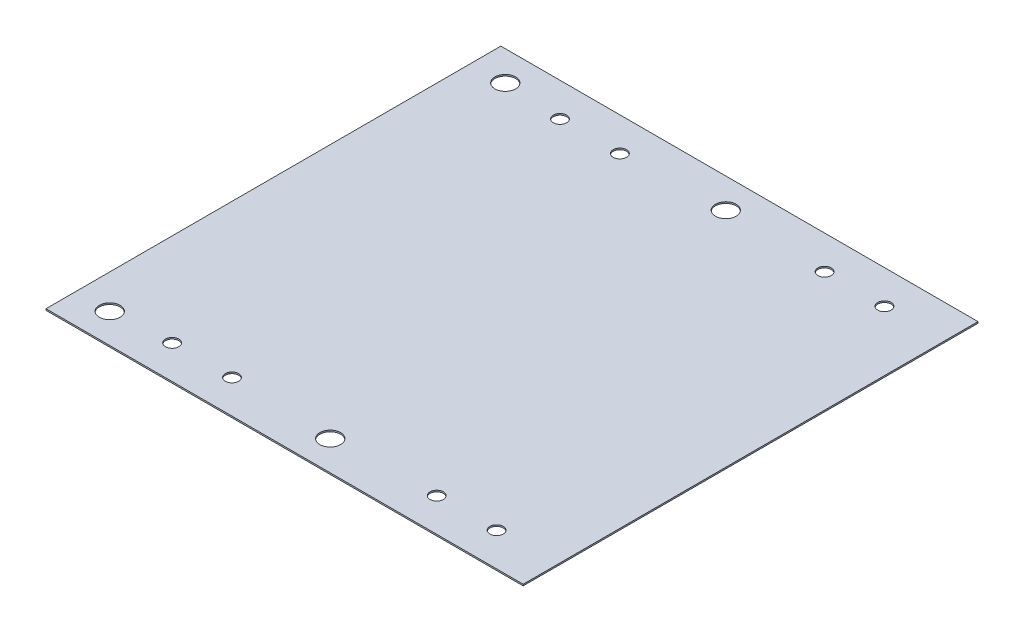
ISO-10303-21;
HEADER;
FILE_DESCRIPTION(('STEP AP214'),'2;1');
FILE_NAME('part.step','',(''),(''),'','','');
FILE_SCHEMA(('AUTOMOTIVE_DESIGN { 1 0 10303 214 1 1 1 1 }'));
ENDSEC;
DATA;
#1=APPLICATION_CONTEXT('core data for automotive mechanical design processes');
#2=APPLICATION_PROTOCOL_DEFINITION('international standard','automotive_design',2000,#1);
#3=PRODUCT_CONTEXT('',#1,'mechanical');
#4=PRODUCT('Part','Part','',(#3));
#5=PRODUCT_RELATED_PRODUCT_CATEGORY('part','',(#4));
#6=PRODUCT_DEFINITION_FORMATION('','',#4);
#7=PRODUCT_DEFINITION_CONTEXT('part definition',#1,'design');
#8=PRODUCT_DEFINITION('design','',#6,#7);
#9=PRODUCT_DEFINITION_SHAPE('','',#8);
#10=(LENGTH_UNIT() NAMED_UNIT(*) SI_UNIT(.MILLI.,.METRE.));
#11=(NAMED_UNIT(*) PLANE_ANGLE_UNIT() SI_UNIT($,.RADIAN.));
#12=(NAMED_UNIT(*) SI_UNIT($,.STERADIAN.) SOLID_ANGLE_UNIT());
#13=UNCERTAINTY_MEASURE_WITH_UNIT(LENGTH_MEASURE(1.E-05),#10,'distance_accuracy_value','');
#14=(GEOMETRIC_REPRESENTATION_CONTEXT(3) GLOBAL_UNCERTAINTY_ASSIGNED_CONTEXT((#13)) GLOBAL_UNIT_ASSIGNED_CONTEXT((#10,
#11,#12)) REPRESENTATION_CONTEXT('',''));
#15=CARTESIAN_POINT('',(0.,0.,0.));
#16=DIRECTION('',(0.,0.,1.));
#17=DIRECTION('',(1.,0.,0.));
#18=AXIS2_PLACEMENT_3D('',#15,#16,#17);
#19=CARTESIAN_POINT('',(40.25,0.25,38.3675));
#20=DIRECTION('',(0.,1.,0.));
#21=DIRECTION('',(0.,0.,1.));
#22=AXIS2_PLACEMENT_3D('',#19,#20,#21);
#23=PLANE('',#22);
#24=CARTESIAN_POINT('',(20.02,0.25,32.7175));
#25=DIRECTION('',(0.,1.,0.));
#26=DIRECTION('',(0.,0.,1.));
#27=AXIS2_PLACEMENT_3D('',#24,#25,#26);
#28=CIRCLE('',#27,1.125);
#29=CARTESIAN_POINT('',(20.02,0.25,33.8425));
#30=VERTEX_POINT('',#29);
#31=EDGE_CURVE('E167',#30,#30,#28,.T.);
#32=ORIENTED_EDGE('',*,*,#31,.F.);
#33=EDGE_LOOP('',(#32));
#34=FACE_BOUND('',#33,.T.);
#35=CARTESIAN_POINT('',(-24.62,0.25,32.7175));
#36=DIRECTION('',(0.,1.,0.));
#37=DIRECTION('',(0.,0.,1.));
#38=AXIS2_PLACEMENT_3D('',#35,#36,#37);
#39=CIRCLE('',#38,1.125);
#40=CARTESIAN_POINT('',(-24.62,0.25,33.8425));
#41=VERTEX_POINT('',#40);
#42=EDGE_CURVE('E155',#41,#41,#39,.T.);
#43=ORIENTED_EDGE('',*,*,#42,.F.);
#44=EDGE_LOOP('',(#43));
#45=FACE_BOUND('',#44,.T.);
#46=CARTESIAN_POINT('',(-34.5,0.25,33.3675));
#47=DIRECTION('',(0.,1.,0.));
#48=DIRECTION('',(0.,0.,1.));
#49=AXIS2_PLACEMENT_3D('',#46,#47,#48);
#50=CIRCLE('',#49,1.75);
#51=CARTESIAN_POINT('',(-34.5,0.25,35.1175));
#52=VERTEX_POINT('',#51);
#53=EDGE_CURVE('E143',#52,#52,#50,.T.);
#54=ORIENTED_EDGE('',*,*,#53,.F.);
#55=EDGE_LOOP('',(#54));
#56=FACE_BOUND('',#55,.T.);
#57=CARTESIAN_POINT('',(20.02,0.25,-32.7175));
#58=DIRECTION('',(0.,1.,0.));
#59=DIRECTION('',(0.,0.,1.));
#60=AXIS2_PLACEMENT_3D('',#57,#58,#59);
#61=CIRCLE('',#60,1.125);
#62=CARTESIAN_POINT('',(20.02,0.25,-31.5925));
#63=VERTEX_POINT('',#62);
#64=EDGE_CURVE('E131',#63,#63,#61,.T.);
#65=ORIENTED_EDGE('',*,*,#64,.F.);
#66=EDGE_LOOP('',(#65));
#67=FACE_BOUND('',#66,.T.);
#68=CARTESIAN_POINT('',(-14.52,0.25,-32.7175));
#69=DIRECTION('',(0.,1.,0.));
#70=DIRECTION('',(0.,0.,1.));
#71=AXIS2_PLACEMENT_3D('',#68,#69,#70);
#72=CIRCLE('',#71,1.125);
#73=CARTESIAN_POINT('',(-14.52,0.25,-31.5925));
#74=VERTEX_POINT('',#73);
#75=EDGE_CURVE('E119',#74,#74,#72,.T.);
#76=ORIENTED_EDGE('',*,*,#75,.F.);
#77=EDGE_LOOP('',(#76));
#78=FACE_BOUND('',#77,.T.);
#79=CARTESIAN_POINT('',(-34.5,0.25,-33.3675));
#80=DIRECTION('',(0.,1.,0.));
#81=DIRECTION('',(0.,0.,1.));
#82=AXIS2_PLACEMENT_3D('',#79,#80,#81);
#83=CIRCLE('',#82,1.75);
#84=CARTESIAN_POINT('',(-34.5,0.25,-31.6175));
#85=VERTEX_POINT('',#84);
#86=EDGE_CURVE('E98',#85,#85,#83,.T.);
#87=ORIENTED_EDGE('',*,*,#86,.F.);
#88=EDGE_LOOP('',(#87));
#89=FACE_BOUND('',#88,.T.);
#90=DIRECTION('',(0.,0.,-1.));
#91=VECTOR('',#90,1.);
#92=CARTESIAN_POINT('',(40.25,0.25,-38.3675));
#93=LINE('',#92,#91);
#94=CARTESIAN_POINT('',(40.25,0.25,38.3675));
#95=VERTEX_POINT('',#94);
#96=CARTESIAN_POINT('',(40.25,0.25,-38.3675));
#97=VERTEX_POINT('',#96);
#98=EDGE_CURVE('E83',#95,#97,#93,.T.);
#99=ORIENTED_EDGE('',*,*,#98,.T.);
#100=DIRECTION('',(-1.,0.,0.));
#101=VECTOR('',#100,1.);
#102=CARTESIAN_POINT('',(-40.25,0.25,-38.3675));
#103=LINE('',#102,#101);
#104=CARTESIAN_POINT('',(-40.25,0.25,-38.3675));
#105=VERTEX_POINT('',#104);
#106=EDGE_CURVE('E78',#97,#105,#103,.T.);
#107=ORIENTED_EDGE('',*,*,#106,.T.);
#108=DIRECTION('',(0.,0.,1.));
#109=VECTOR('',#108,1.);
#110=CARTESIAN_POINT('',(-40.25,0.25,-38.3675));
#111=LINE('',#110,#109);
#112=CARTESIAN_POINT('',(-40.25,0.25,38.3675));
#113=VERTEX_POINT('',#112);
#114=EDGE_CURVE('E81',#105,#113,#111,.T.);
#115=ORIENTED_EDGE('',*,*,#114,.T.);
#116=DIRECTION('',(1.,0.,0.));
#117=VECTOR('',#116,1.);
#118=CARTESIAN_POINT('',(-40.25,0.25,38.3675));
#119=LINE('',#118,#117);
#120=EDGE_CURVE('E48',#113,#95,#119,.T.);
#121=ORIENTED_EDGE('',*,*,#120,.T.);
#122=EDGE_LOOP('',(#99,#107,#115,#121));
#123=FACE_BOUND('',#122,.T.);
#124=CARTESIAN_POINT('',(-24.62,0.25,-32.7175));
#125=DIRECTION('',(0.,1.,0.));
#126=DIRECTION('',(0.,0.,1.));
#127=AXIS2_PLACEMENT_3D('',#124,#125,#126);
#128=CIRCLE('',#127,1.125);
#129=CARTESIAN_POINT('',(-24.62,0.25,-31.5925));
#130=VERTEX_POINT('',#129);
#131=EDGE_CURVE('E113',#130,#130,#128,.T.);
#132=ORIENTED_EDGE('',*,*,#131,.F.);
#133=EDGE_LOOP('',(#132));
#134=FACE_BOUND('',#133,.T.);
#135=CARTESIAN_POINT('',(2.69999999999999,0.25,-33.3675));
#136=DIRECTION('',(0.,1.,0.));
#137=DIRECTION('',(0.,0.,1.));
#138=AXIS2_PLACEMENT_3D('',#135,#136,#137);
#139=CIRCLE('',#138,1.75);
#140=CARTESIAN_POINT('',(2.69999999999999,0.25,-31.6175));
#141=VERTEX_POINT('',#140);
#142=EDGE_CURVE('E125',#141,#141,#139,.T.);
#143=ORIENTED_EDGE('',*,*,#142,.F.);
#144=EDGE_LOOP('',(#143));
#145=FACE_BOUND('',#144,.T.);
#146=CARTESIAN_POINT('',(30.12,0.25,-32.7175));
#147=DIRECTION('',(0.,1.,0.));
#148=DIRECTION('',(0.,0.,1.));
#149=AXIS2_PLACEMENT_3D('',#146,#147,#148);
#150=CIRCLE('',#149,1.125);
#151=CARTESIAN_POINT('',(30.12,0.25,-31.5925));
#152=VERTEX_POINT('',#151);
#153=EDGE_CURVE('E137',#152,#152,#150,.T.);
#154=ORIENTED_EDGE('',*,*,#153,.F.);
#155=EDGE_LOOP('',(#154));
#156=FACE_BOUND('',#155,.T.);
#157=CARTESIAN_POINT('',(2.69999999999999,0.25,33.3675));
#158=DIRECTION('',(0.,1.,0.));
#159=DIRECTION('',(0.,0.,1.));
#160=AXIS2_PLACEMENT_3D('',#157,#158,#159);
#161=CIRCLE('',#160,1.75);
#162=CARTESIAN_POINT('',(2.69999999999999,0.25,35.1175));
#163=VERTEX_POINT('',#162);
#164=EDGE_CURVE('E149',#163,#163,#161,.T.);
#165=ORIENTED_EDGE('',*,*,#164,.F.);
#166=EDGE_LOOP('',(#165));
#167=FACE_BOUND('',#166,.T.);
#168=CARTESIAN_POINT('',(-14.52,0.25,32.7175));
#169=DIRECTION('',(0.,1.,0.));
#170=DIRECTION('',(0.,0.,1.));
#171=AXIS2_PLACEMENT_3D('',#168,#169,#170);
#172=CIRCLE('',#171,1.125);
#173=CARTESIAN_POINT('',(-14.52,0.25,33.8425));
#174=VERTEX_POINT('',#173);
#175=EDGE_CURVE('E161',#174,#174,#172,.T.);
#176=ORIENTED_EDGE('',*,*,#175,.F.);
#177=EDGE_LOOP('',(#176));
#178=FACE_BOUND('',#177,.T.);
#179=CARTESIAN_POINT('',(30.12,0.25,32.7175));
#180=DIRECTION('',(0.,1.,0.));
#181=DIRECTION('',(0.,0.,1.));
#182=AXIS2_PLACEMENT_3D('',#179,#180,#181);
#183=CIRCLE('',#182,1.125);
#184=CARTESIAN_POINT('',(30.12,0.25,33.8425));
#185=VERTEX_POINT('',#184);
#186=EDGE_CURVE('E173',#185,#185,#183,.T.);
#187=ORIENTED_EDGE('',*,*,#186,.F.);
#188=EDGE_LOOP('',(#187));
#189=FACE_BOUND('',#188,.T.);
#190=ADVANCED_FACE('F31',(#34,#45,#56,#67,#78,#89,#123,#134,#145,#156,#167,#178,#189),#23,.T.);
#191=CARTESIAN_POINT('',(40.25,0.,38.3675));
#192=DIRECTION('',(0.,1.,0.));
#193=DIRECTION('',(0.,0.,1.));
#194=AXIS2_PLACEMENT_3D('',#191,#192,#193);
#195=PLANE('',#194);
#196=CARTESIAN_POINT('',(20.02,0.,32.7175));
#197=DIRECTION('',(0.,1.,0.));
#198=DIRECTION('',(0.,0.,1.));
#199=AXIS2_PLACEMENT_3D('',#196,#197,#198);
#200=CIRCLE('',#199,1.125);
#201=CARTESIAN_POINT('',(20.02,0.,33.8425));
#202=VERTEX_POINT('',#201);
#203=EDGE_CURVE('E170',#202,#202,#200,.T.);
#204=ORIENTED_EDGE('',*,*,#203,.T.);
#205=EDGE_LOOP('',(#204));
#206=FACE_BOUND('',#205,.T.);
#207=CARTESIAN_POINT('',(-24.62,0.,32.7175));
#208=DIRECTION('',(0.,1.,0.));
#209=DIRECTION('',(0.,0.,1.));
#210=AXIS2_PLACEMENT_3D('',#207,#208,#209);
#211=CIRCLE('',#210,1.125);
#212=CARTESIAN_POINT('',(-24.62,0.,33.8425));
#213=VERTEX_POINT('',#212);
#214=EDGE_CURVE('E158',#213,#213,#211,.T.);
#215=ORIENTED_EDGE('',*,*,#214,.T.);
#216=EDGE_LOOP('',(#215));
#217=FACE_BOUND('',#216,.T.);
#218=CARTESIAN_POINT('',(-34.5,0.,33.3675));
#219=DIRECTION('',(0.,1.,0.));
#220=DIRECTION('',(0.,0.,1.));
#221=AXIS2_PLACEMENT_3D('',#218,#219,#220);
#222=CIRCLE('',#221,1.75);
#223=CARTESIAN_POINT('',(-34.5,0.,35.1175));
#224=VERTEX_POINT('',#223);
#225=EDGE_CURVE('E146',#224,#224,#222,.T.);
#226=ORIENTED_EDGE('',*,*,#225,.T.);
#227=EDGE_LOOP('',(#226));
#228=FACE_BOUND('',#227,.T.);
#229=CARTESIAN_POINT('',(20.02,0.,-32.7175));
#230=DIRECTION('',(0.,1.,0.));
#231=DIRECTION('',(0.,0.,1.));
#232=AXIS2_PLACEMENT_3D('',#229,#230,#231);
#233=CIRCLE('',#232,1.125);
#234=CARTESIAN_POINT('',(20.02,0.,-31.5925));
#235=VERTEX_POINT('',#234);
#236=EDGE_CURVE('E134',#235,#235,#233,.T.);
#237=ORIENTED_EDGE('',*,*,#236,.T.);
#238=EDGE_LOOP('',(#237));
#239=FACE_BOUND('',#238,.T.);
#240=CARTESIAN_POINT('',(-14.52,0.,-32.7175));
#241=DIRECTION('',(0.,1.,0.));
#242=DIRECTION('',(0.,0.,1.));
#243=AXIS2_PLACEMENT_3D('',#240,#241,#242);
#244=CIRCLE('',#243,1.125);
#245=CARTESIAN_POINT('',(-14.52,0.,-31.5925));
#246=VERTEX_POINT('',#245);
#247=EDGE_CURVE('E122',#246,#246,#244,.T.);
#248=ORIENTED_EDGE('',*,*,#247,.T.);
#249=EDGE_LOOP('',(#248));
#250=FACE_BOUND('',#249,.T.);
#251=CARTESIAN_POINT('',(-34.5,0.,-33.3675));
#252=DIRECTION('',(0.,1.,0.));
#253=DIRECTION('',(0.,0.,1.));
#254=AXIS2_PLACEMENT_3D('',#251,#252,#253);
#255=CIRCLE('',#254,1.75);
#256=CARTESIAN_POINT('',(-34.5,0.,-31.6175));
#257=VERTEX_POINT('',#256);
#258=EDGE_CURVE('E110',#257,#257,#255,.T.);
#259=ORIENTED_EDGE('',*,*,#258,.T.);
#260=EDGE_LOOP('',(#259));
#261=FACE_BOUND('',#260,.T.);
#262=DIRECTION('',(0.,0.,-1.));
#263=VECTOR('',#262,1.);
#264=CARTESIAN_POINT('',(40.25,0.,-38.3675));
#265=LINE('',#264,#263);
#266=CARTESIAN_POINT('',(40.25,0.,38.3675));
#267=VERTEX_POINT('',#266);
#268=CARTESIAN_POINT('',(40.25,0.,-38.3675));
#269=VERTEX_POINT('',#268);
#270=EDGE_CURVE('E95',#267,#269,#265,.T.);
#271=ORIENTED_EDGE('',*,*,#270,.F.);
#272=DIRECTION('',(1.,0.,0.));
#273=VECTOR('',#272,1.);
#274=CARTESIAN_POINT('',(-40.25,0.,38.3675));
#275=LINE('',#274,#273);
#276=CARTESIAN_POINT('',(-40.25,0.,38.3675));
#277=VERTEX_POINT('',#276);
#278=EDGE_CURVE('E71',#277,#267,#275,.T.);
#279=ORIENTED_EDGE('',*,*,#278,.F.);
#280=DIRECTION('',(0.,0.,1.));
#281=VECTOR('',#280,1.);
#282=CARTESIAN_POINT('',(-40.25,0.,-38.3675));
#283=LINE('',#282,#281);
#284=CARTESIAN_POINT('',(-40.25,0.,-38.3675));
#285=VERTEX_POINT('',#284);
#286=EDGE_CURVE('E65',#285,#277,#283,.T.);
#287=ORIENTED_EDGE('',*,*,#286,.F.);
#288=DIRECTION('',(-1.,0.,0.));
#289=VECTOR('',#288,1.);
#290=CARTESIAN_POINT('',(-40.25,0.,-38.3675));
#291=LINE('',#290,#289);
#292=EDGE_CURVE('E87',#269,#285,#291,.T.);
#293=ORIENTED_EDGE('',*,*,#292,.F.);
#294=EDGE_LOOP('',(#271,#279,#287,#293));
#295=FACE_BOUND('',#294,.T.);
#296=CARTESIAN_POINT('',(-24.62,0.,-32.7175));
#297=DIRECTION('',(0.,1.,0.));
#298=DIRECTION('',(0.,0.,1.));
#299=AXIS2_PLACEMENT_3D('',#296,#297,#298);
#300=CIRCLE('',#299,1.125);
#301=CARTESIAN_POINT('',(-24.62,0.,-31.5925));
#302=VERTEX_POINT('',#301);
#303=EDGE_CURVE('E116',#302,#302,#300,.T.);
#304=ORIENTED_EDGE('',*,*,#303,.T.);
#305=EDGE_LOOP('',(#304));
#306=FACE_BOUND('',#305,.T.);
#307=CARTESIAN_POINT('',(2.69999999999999,0.,-33.3675));
#308=DIRECTION('',(0.,1.,0.));
#309=DIRECTION('',(0.,0.,1.));
#310=AXIS2_PLACEMENT_3D('',#307,#308,#309);
#311=CIRCLE('',#310,1.75);
#312=CARTESIAN_POINT('',(2.69999999999999,0.,-31.6175));
#313=VERTEX_POINT('',#312);
#314=EDGE_CURVE('E128',#313,#313,#311,.T.);
#315=ORIENTED_EDGE('',*,*,#314,.T.);
#316=EDGE_LOOP('',(#315));
#317=FACE_BOUND('',#316,.T.);
#318=CARTESIAN_POINT('',(30.12,0.,-32.7175));
#319=DIRECTION('',(0.,1.,0.));
#320=DIRECTION('',(0.,0.,1.));
#321=AXIS2_PLACEMENT_3D('',#318,#319,#320);
#322=CIRCLE('',#321,1.125);
#323=CARTESIAN_POINT('',(30.12,0.,-31.5925));
#324=VERTEX_POINT('',#323);
#325=EDGE_CURVE('E140',#324,#324,#322,.T.);
#326=ORIENTED_EDGE('',*,*,#325,.T.);
#327=EDGE_LOOP('',(#326));
#328=FACE_BOUND('',#327,.T.);
#329=CARTESIAN_POINT('',(2.69999999999999,0.,33.3675));
#330=DIRECTION('',(0.,1.,0.));
#331=DIRECTION('',(0.,0.,1.));
#332=AXIS2_PLACEMENT_3D('',#329,#330,#331);
#333=CIRCLE('',#332,1.75);
#334=CARTESIAN_POINT('',(2.69999999999999,0.,35.1175));
#335=VERTEX_POINT('',#334);
#336=EDGE_CURVE('E152',#335,#335,#333,.T.);
#337=ORIENTED_EDGE('',*,*,#336,.T.);
#338=EDGE_LOOP('',(#337));
#339=FACE_BOUND('',#338,.T.);
#340=CARTESIAN_POINT('',(-14.52,0.,32.7175));
#341=DIRECTION('',(0.,1.,0.));
#342=DIRECTION('',(0.,0.,1.));
#343=AXIS2_PLACEMENT_3D('',#340,#341,#342);
#344=CIRCLE('',#343,1.125);
#345=CARTESIAN_POINT('',(-14.52,0.,33.8425));
#346=VERTEX_POINT('',#345);
#347=EDGE_CURVE('E164',#346,#346,#344,.T.);
#348=ORIENTED_EDGE('',*,*,#347,.T.);
#349=EDGE_LOOP('',(#348));
#350=FACE_BOUND('',#349,.T.);
#351=CARTESIAN_POINT('',(30.12,0.,32.7175));
#352=DIRECTION('',(0.,1.,0.));
#353=DIRECTION('',(0.,0.,1.));
#354=AXIS2_PLACEMENT_3D('',#351,#352,#353);
#355=CIRCLE('',#354,1.125);
#356=CARTESIAN_POINT('',(30.12,0.,33.8425));
#357=VERTEX_POINT('',#356);
#358=EDGE_CURVE('E176',#357,#357,#355,.T.);
#359=ORIENTED_EDGE('',*,*,#358,.T.);
#360=EDGE_LOOP('',(#359));
#361=FACE_BOUND('',#360,.T.);
#362=ADVANCED_FACE('F106',(#206,#217,#228,#239,#250,#261,#295,#306,#317,#328,#339,#350,#361),
#195,.F.);
#363=CARTESIAN_POINT('',(40.25,0.25,-38.3675));
#364=DIRECTION('',(-1.,0.,0.));
#365=DIRECTION('',(0.,0.,1.));
#366=AXIS2_PLACEMENT_3D('',#363,#364,#365);
#367=PLANE('',#366);
#368=ORIENTED_EDGE('',*,*,#270,.T.);
#369=DIRECTION('',(0.,-1.,0.));
#370=VECTOR('',#369,1.);
#371=CARTESIAN_POINT('',(40.25,0.25,-38.3675));
#372=LINE('',#371,#370);
#373=EDGE_CURVE('E11',#97,#269,#372,.T.);
#374=ORIENTED_EDGE('',*,*,#373,.F.);
#375=ORIENTED_EDGE('',*,*,#98,.F.);
#376=DIRECTION('',(0.,-1.,0.));
#377=VECTOR('',#376,1.);
#378=CARTESIAN_POINT('',(40.25,0.25,38.3675));
#379=LINE('',#378,#377);
#380=EDGE_CURVE('E91',#95,#267,#379,.T.);
#381=ORIENTED_EDGE('',*,*,#380,.T.);
#382=EDGE_LOOP('',(#368,#374,#375,#381));
#383=FACE_BOUND('',#382,.T.);
#384=ADVANCED_FACE('F33',(#383),#367,.F.);
#385=CARTESIAN_POINT('',(-40.25,0.25,-38.3675));
#386=DIRECTION('',(0.,0.,1.));
#387=DIRECTION('',(1.,0.,0.));
#388=AXIS2_PLACEMENT_3D('',#385,#386,#387);
#389=PLANE('',#388);
#390=ORIENTED_EDGE('',*,*,#292,.T.);
#391=DIRECTION('',(0.,-1.,0.));
#392=VECTOR('',#391,1.);
#393=CARTESIAN_POINT('',(-40.25,0.25,-38.3675));
#394=LINE('',#393,#392);
#395=EDGE_CURVE('E40',#105,#285,#394,.T.);
#396=ORIENTED_EDGE('',*,*,#395,.F.);
#397=ORIENTED_EDGE('',*,*,#106,.F.);
#398=ORIENTED_EDGE('',*,*,#373,.T.);
#399=EDGE_LOOP('',(#390,#396,#397,#398));
#400=FACE_BOUND('',#399,.T.);
#401=ADVANCED_FACE('F86',(#400),#389,.F.);
#402=CARTESIAN_POINT('',(-40.25,0.25,-38.3675));
#403=DIRECTION('',(1.,0.,0.));
#404=DIRECTION('',(0.,0.,-1.));
#405=AXIS2_PLACEMENT_3D('',#402,#403,#404);
#406=PLANE('',#405);
#407=ORIENTED_EDGE('',*,*,#286,.T.);
#408=DIRECTION('',(0.,-1.,0.));
#409=VECTOR('',#408,1.);
#410=CARTESIAN_POINT('',(-40.25,0.25,38.3675));
#411=LINE('',#410,#409);
#412=EDGE_CURVE('E88',#113,#277,#411,.T.);
#413=ORIENTED_EDGE('',*,*,#412,.F.);
#414=ORIENTED_EDGE('',*,*,#114,.F.);
#415=ORIENTED_EDGE('',*,*,#395,.T.);
#416=EDGE_LOOP('',(#407,#413,#414,#415));
#417=FACE_BOUND('',#416,.T.);
#418=ADVANCED_FACE('F89',(#417),#406,.F.);
#419=CARTESIAN_POINT('',(-40.25,0.25,38.3675));
#420=DIRECTION('',(0.,0.,-1.));
#421=DIRECTION('',(-1.,0.,0.));
#422=AXIS2_PLACEMENT_3D('',#419,#420,#421);
#423=PLANE('',#422);
#424=ORIENTED_EDGE('',*,*,#278,.T.);
#425=ORIENTED_EDGE('',*,*,#380,.F.);
#426=ORIENTED_EDGE('',*,*,#120,.F.);
#427=ORIENTED_EDGE('',*,*,#412,.T.);
#428=EDGE_LOOP('',(#424,#425,#426,#427));
#429=FACE_BOUND('',#428,.T.);
#430=ADVANCED_FACE('F103',(#429),#423,.F.);
#431=CARTESIAN_POINT('',(-34.5,0.25,-33.3675));
#432=DIRECTION('',(0.,-1.,0.));
#433=DIRECTION('',(0.,0.,-1.));
#434=AXIS2_PLACEMENT_3D('',#431,#432,#433);
#435=CYLINDRICAL_SURFACE('',#434,1.75);
#436=ORIENTED_EDGE('',*,*,#86,.T.);
#437=EDGE_LOOP('',(#436));
#438=FACE_BOUND('',#437,.T.);
#439=ORIENTED_EDGE('',*,*,#258,.F.);
#440=EDGE_LOOP('',(#439));
#441=FACE_BOUND('',#440,.T.);
#442=ADVANCED_FACE('F196',(#438,#441),#435,.F.);
#443=CARTESIAN_POINT('',(-24.62,0.25,-32.7175));
#444=DIRECTION('',(0.,-1.,0.));
#445=DIRECTION('',(0.,0.,-1.));
#446=AXIS2_PLACEMENT_3D('',#443,#444,#445);
#447=CYLINDRICAL_SURFACE('',#446,1.125);
#448=ORIENTED_EDGE('',*,*,#131,.T.);
#449=EDGE_LOOP('',(#448));
#450=FACE_BOUND('',#449,.T.);
#451=ORIENTED_EDGE('',*,*,#303,.F.);
#452=EDGE_LOOP('',(#451));
#453=FACE_BOUND('',#452,.T.);
#454=ADVANCED_FACE('F242',(#450,#453),#447,.F.);
#455=CARTESIAN_POINT('',(-14.52,0.25,-32.7175));
#456=DIRECTION('',(0.,-1.,0.));
#457=DIRECTION('',(0.,0.,-1.));
#458=AXIS2_PLACEMENT_3D('',#455,#456,#457);
#459=CYLINDRICAL_SURFACE('',#458,1.125);
#460=ORIENTED_EDGE('',*,*,#75,.T.);
#461=EDGE_LOOP('',(#460));
#462=FACE_BOUND('',#461,.T.);
#463=ORIENTED_EDGE('',*,*,#247,.F.);
#464=EDGE_LOOP('',(#463));
#465=FACE_BOUND('',#464,.T.);
#466=ADVANCED_FACE('F250',(#462,#465),#459,.F.);
#467=CARTESIAN_POINT('',(2.69999999999999,0.25,-33.3675));
#468=DIRECTION('',(0.,-1.,0.));
#469=DIRECTION('',(0.,0.,-1.));
#470=AXIS2_PLACEMENT_3D('',#467,#468,#469);
#471=CYLINDRICAL_SURFACE('',#470,1.75);
#472=ORIENTED_EDGE('',*,*,#142,.T.);
#473=EDGE_LOOP('',(#472));
#474=FACE_BOUND('',#473,.T.);
#475=ORIENTED_EDGE('',*,*,#314,.F.);
#476=EDGE_LOOP('',(#475));
#477=FACE_BOUND('',#476,.T.);
#478=ADVANCED_FACE('F258',(#474,#477),#471,.F.);
#479=CARTESIAN_POINT('',(20.02,0.25,-32.7175));
#480=DIRECTION('',(0.,-1.,0.));
#481=DIRECTION('',(0.,0.,-1.));
#482=AXIS2_PLACEMENT_3D('',#479,#480,#481);
#483=CYLINDRICAL_SURFACE('',#482,1.125);
#484=ORIENTED_EDGE('',*,*,#64,.T.);
#485=EDGE_LOOP('',(#484));
#486=FACE_BOUND('',#485,.T.);
#487=ORIENTED_EDGE('',*,*,#236,.F.);
#488=EDGE_LOOP('',(#487));
#489=FACE_BOUND('',#488,.T.);
#490=ADVANCED_FACE('F267',(#486,#489),#483,.F.);
#491=CARTESIAN_POINT('',(30.12,0.25,-32.7175));
#492=DIRECTION('',(0.,-1.,0.));
#493=DIRECTION('',(0.,0.,-1.));
#494=AXIS2_PLACEMENT_3D('',#491,#492,#493);
#495=CYLINDRICAL_SURFACE('',#494,1.125);
#496=ORIENTED_EDGE('',*,*,#153,.T.);
#497=EDGE_LOOP('',(#496));
#498=FACE_BOUND('',#497,.T.);
#499=ORIENTED_EDGE('',*,*,#325,.F.);
#500=EDGE_LOOP('',(#499));
#501=FACE_BOUND('',#500,.T.);
#502=ADVANCED_FACE('F276',(#498,#501),#495,.F.);
#503=CARTESIAN_POINT('',(-34.5,0.25,33.3675));
#504=DIRECTION('',(0.,-1.,0.));
#505=DIRECTION('',(0.,0.,-1.));
#506=AXIS2_PLACEMENT_3D('',#503,#504,#505);
#507=CYLINDRICAL_SURFACE('',#506,1.75);
#508=ORIENTED_EDGE('',*,*,#53,.T.);
#509=EDGE_LOOP('',(#508));
#510=FACE_BOUND('',#509,.T.);
#511=ORIENTED_EDGE('',*,*,#225,.F.);
#512=EDGE_LOOP('',(#511));
#513=FACE_BOUND('',#512,.T.);
#514=ADVANCED_FACE('F285',(#510,#513),#507,.F.);
#515=CARTESIAN_POINT('',(2.69999999999999,0.25,33.3675));
#516=DIRECTION('',(0.,-1.,0.));
#517=DIRECTION('',(0.,0.,-1.));
#518=AXIS2_PLACEMENT_3D('',#515,#516,#517);
#519=CYLINDRICAL_SURFACE('',#518,1.75);
#520=ORIENTED_EDGE('',*,*,#164,.T.);
#521=EDGE_LOOP('',(#520));
#522=FACE_BOUND('',#521,.T.);
#523=ORIENTED_EDGE('',*,*,#336,.F.);
#524=EDGE_LOOP('',(#523));
#525=FACE_BOUND('',#524,.T.);
#526=ADVANCED_FACE('F294',(#522,#525),#519,.F.);
#527=CARTESIAN_POINT('',(-24.62,0.25,32.7175));
#528=DIRECTION('',(0.,-1.,0.));
#529=DIRECTION('',(0.,0.,-1.));
#530=AXIS2_PLACEMENT_3D('',#527,#528,#529);
#531=CYLINDRICAL_SURFACE('',#530,1.125);
#532=ORIENTED_EDGE('',*,*,#42,.T.);
#533=EDGE_LOOP('',(#532));
#534=FACE_BOUND('',#533,.T.);
#535=ORIENTED_EDGE('',*,*,#214,.F.);
#536=EDGE_LOOP('',(#535));
#537=FACE_BOUND('',#536,.T.);
#538=ADVANCED_FACE('F303',(#534,#537),#531,.F.);
#539=CARTESIAN_POINT('',(-14.52,0.25,32.7175));
#540=DIRECTION('',(0.,-1.,0.));
#541=DIRECTION('',(0.,0.,-1.));
#542=AXIS2_PLACEMENT_3D('',#539,#540,#541);
#543=CYLINDRICAL_SURFACE('',#542,1.125);
#544=ORIENTED_EDGE('',*,*,#175,.T.);
#545=EDGE_LOOP('',(#544));
#546=FACE_BOUND('',#545,.T.);
#547=ORIENTED_EDGE('',*,*,#347,.F.);
#548=EDGE_LOOP('',(#547));
#549=FACE_BOUND('',#548,.T.);
#550=ADVANCED_FACE('F312',(#546,#549),#543,.F.);
#551=CARTESIAN_POINT('',(20.02,0.25,32.7175));
#552=DIRECTION('',(0.,-1.,0.));
#553=DIRECTION('',(0.,0.,-1.));
#554=AXIS2_PLACEMENT_3D('',#551,#552,#553);
#555=CYLINDRICAL_SURFACE('',#554,1.125);
#556=ORIENTED_EDGE('',*,*,#31,.T.);
#557=EDGE_LOOP('',(#556));
#558=FACE_BOUND('',#557,.T.);
#559=ORIENTED_EDGE('',*,*,#203,.F.);
#560=EDGE_LOOP('',(#559));
#561=FACE_BOUND('',#560,.T.);
#562=ADVANCED_FACE('F321',(#558,#561),#555,.F.);
#563=CARTESIAN_POINT('',(30.12,0.25,32.7175));
#564=DIRECTION('',(0.,-1.,0.));
#565=DIRECTION('',(0.,0.,-1.));
#566=AXIS2_PLACEMENT_3D('',#563,#564,#565);
#567=CYLINDRICAL_SURFACE('',#566,1.125);
#568=ORIENTED_EDGE('',*,*,#186,.T.);
#569=EDGE_LOOP('',(#568));
#570=FACE_BOUND('',#569,.T.);
#571=ORIENTED_EDGE('',*,*,#358,.F.);
#572=EDGE_LOOP('',(#571));
#573=FACE_BOUND('',#572,.T.);
#574=ADVANCED_FACE('F182',(#570,#573),#567,.F.);
#575=CLOSED_SHELL('',(#190,#362,#384,#401,#418,#430,#442,#454,#466,#478,#490,#502,#514,#526,
#538,#550,#562,#574));
#576=MANIFOLD_SOLID_BREP('B2',#575);
#577=ADVANCED_BREP_SHAPE_REPRESENTATION('',(#18,#576),#14);
#578=SHAPE_DEFINITION_REPRESENTATION(#9,#577);
ENDSEC;
END-ISO-10303-21;
